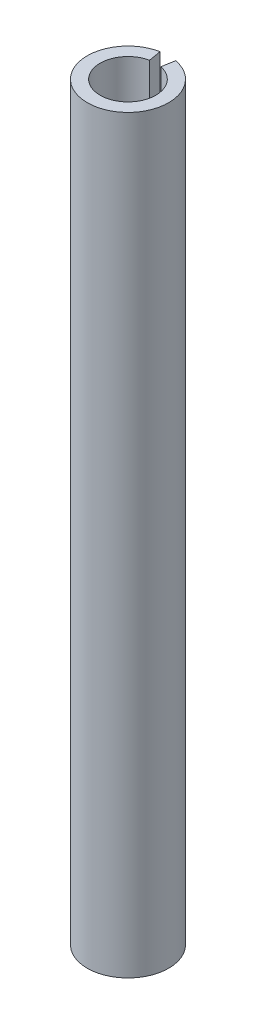
ISO-10303-21;
HEADER;
FILE_DESCRIPTION(('STEP AP214'),'2;1');
FILE_NAME('part.step','',(''),(''),'','','');
FILE_SCHEMA(('AUTOMOTIVE_DESIGN { 1 0 10303 214 1 1 1 1 }'));
ENDSEC;
DATA;
#1=APPLICATION_CONTEXT('core data for automotive mechanical design processes');
#2=APPLICATION_PROTOCOL_DEFINITION('international standard','automotive_design',2000,#1);
#3=PRODUCT_CONTEXT('',#1,'mechanical');
#4=PRODUCT('Part','Part','',(#3));
#5=PRODUCT_RELATED_PRODUCT_CATEGORY('part','',(#4));
#6=PRODUCT_DEFINITION_FORMATION('','',#4);
#7=PRODUCT_DEFINITION_CONTEXT('part definition',#1,'design');
#8=PRODUCT_DEFINITION('design','',#6,#7);
#9=PRODUCT_DEFINITION_SHAPE('','',#8);
#10=(LENGTH_UNIT() NAMED_UNIT(*) SI_UNIT(.MILLI.,.METRE.));
#11=(NAMED_UNIT(*) PLANE_ANGLE_UNIT() SI_UNIT($,.RADIAN.));
#12=(NAMED_UNIT(*) SI_UNIT($,.STERADIAN.) SOLID_ANGLE_UNIT());
#13=UNCERTAINTY_MEASURE_WITH_UNIT(LENGTH_MEASURE(1.E-05),#10,'distance_accuracy_value','');
#14=(GEOMETRIC_REPRESENTATION_CONTEXT(3) GLOBAL_UNCERTAINTY_ASSIGNED_CONTEXT((#13)) GLOBAL_UNIT_ASSIGNED_CONTEXT((#10,
#11,#12)) REPRESENTATION_CONTEXT('',''));
#15=CARTESIAN_POINT('',(0.,0.,0.));
#16=DIRECTION('',(0.,0.,1.));
#17=DIRECTION('',(1.,0.,0.));
#18=AXIS2_PLACEMENT_3D('',#15,#16,#17);
#19=CARTESIAN_POINT('',(0.,175.02,0.));
#20=DIRECTION('',(0.,1.,0.));
#21=DIRECTION('',(0.,0.,1.));
#22=AXIS2_PLACEMENT_3D('',#19,#20,#21);
#23=PLANE('',#22);
#24=DIRECTION('',(0.169230769230769,0.,-0.98557645403366));
#25=VECTOR('',#24,1.);
#26=CARTESIAN_POINT('',(0.218910676143961,175.02,0.0375885827680346));
#27=LINE('',#26,#25);
#28=CARTESIAN_POINT('',(1.31826826057475,175.02,-6.3649170295583));
#29=VERTEX_POINT('',#28);
#30=CARTESIAN_POINT('',(1.82616350462444,175.02,-9.32282826476911));
#31=VERTEX_POINT('',#30);
#32=EDGE_CURVE('E74',#29,#31,#27,.T.);
#33=ORIENTED_EDGE('',*,*,#32,.F.);
#34=CARTESIAN_POINT('',(0.,175.02,0.));
#35=DIRECTION('',(0.,1.,0.));
#36=DIRECTION('',(0.,0.,1.));
#37=AXIS2_PLACEMENT_3D('',#34,#35,#36);
#38=CIRCLE('',#37,6.5);
#39=CARTESIAN_POINT('',(-1.31826826057475,175.02,-6.3649170295583));
#40=VERTEX_POINT('',#39);
#41=EDGE_CURVE('E93',#40,#29,#38,.T.);
#42=ORIENTED_EDGE('',*,*,#41,.F.);
#43=DIRECTION('',(0.169230769230769,0.,0.98557645403366));
#44=VECTOR('',#43,1.);
#45=CARTESIAN_POINT('',(-0.218910676143961,175.02,0.0375885827680347));
#46=LINE('',#45,#44);
#47=CARTESIAN_POINT('',(-1.82616350462444,175.02,-9.32282826476911));
#48=VERTEX_POINT('',#47);
#49=EDGE_CURVE('E55',#48,#40,#46,.T.);
#50=ORIENTED_EDGE('',*,*,#49,.F.);
#51=CARTESIAN_POINT('',(0.,175.02,0.));
#52=DIRECTION('',(0.,1.,0.));
#53=DIRECTION('',(0.,0.,1.));
#54=AXIS2_PLACEMENT_3D('',#51,#52,#53);
#55=CIRCLE('',#54,9.5);
#56=EDGE_CURVE('E92',#48,#31,#55,.T.);
#57=ORIENTED_EDGE('',*,*,#56,.T.);
#58=EDGE_LOOP('',(#33,#42,#50,#57));
#59=FACE_BOUND('',#58,.T.);
#60=ADVANCED_FACE('F33',(#59),#23,.T.);
#61=CARTESIAN_POINT('',(0.,0.,0.));
#62=DIRECTION('',(0.,1.,0.));
#63=DIRECTION('',(0.,0.,1.));
#64=AXIS2_PLACEMENT_3D('',#61,#62,#63);
#65=PLANE('',#64);
#66=CARTESIAN_POINT('',(0.,0.,0.));
#67=DIRECTION('',(0.,1.,0.));
#68=DIRECTION('',(0.,0.,1.));
#69=AXIS2_PLACEMENT_3D('',#66,#67,#68);
#70=CIRCLE('',#69,6.5);
#71=CARTESIAN_POINT('',(-1.31826826057475,0.,-6.3649170295583));
#72=VERTEX_POINT('',#71);
#73=CARTESIAN_POINT('',(1.31826826057475,0.,-6.3649170295583));
#74=VERTEX_POINT('',#73);
#75=EDGE_CURVE('E79',#72,#74,#70,.T.);
#76=ORIENTED_EDGE('',*,*,#75,.T.);
#77=DIRECTION('',(0.169230769230769,0.,-0.98557645403366));
#78=VECTOR('',#77,1.);
#79=CARTESIAN_POINT('',(1.1,0.,-5.09375304878121));
#80=LINE('',#79,#78);
#81=CARTESIAN_POINT('',(1.82616350462444,0.,-9.32282826476911));
#82=VERTEX_POINT('',#81);
#83=EDGE_CURVE('E47',#74,#82,#80,.T.);
#84=ORIENTED_EDGE('',*,*,#83,.T.);
#85=CARTESIAN_POINT('',(0.,0.,0.));
#86=DIRECTION('',(0.,1.,0.));
#87=DIRECTION('',(0.,0.,1.));
#88=AXIS2_PLACEMENT_3D('',#85,#86,#87);
#89=CIRCLE('',#88,9.5);
#90=CARTESIAN_POINT('',(-1.82616350462444,0.,-9.32282826476911));
#91=VERTEX_POINT('',#90);
#92=EDGE_CURVE('E86',#91,#82,#89,.T.);
#93=ORIENTED_EDGE('',*,*,#92,.F.);
#94=DIRECTION('',(0.169230769230769,0.,0.98557645403366));
#95=VECTOR('',#94,1.);
#96=CARTESIAN_POINT('',(-2.2,0.,-11.5));
#97=LINE('',#96,#95);
#98=EDGE_CURVE('E88',#91,#72,#97,.T.);
#99=ORIENTED_EDGE('',*,*,#98,.T.);
#100=EDGE_LOOP('',(#76,#84,#93,#99));
#101=FACE_BOUND('',#100,.T.);
#102=ADVANCED_FACE('F84',(#101),#65,.F.);
#103=CARTESIAN_POINT('',(0.,175.02,0.));
#104=DIRECTION('',(0.,-1.,0.));
#105=DIRECTION('',(0.,0.,-1.));
#106=AXIS2_PLACEMENT_3D('',#103,#104,#105);
#107=CYLINDRICAL_SURFACE('',#106,9.5);
#108=ORIENTED_EDGE('',*,*,#92,.T.);
#109=DIRECTION('',(0.,-1.,0.));
#110=VECTOR('',#109,1.);
#111=CARTESIAN_POINT('',(1.82616350462444,175.02,-9.32282826476911));
#112=LINE('',#111,#110);
#113=EDGE_CURVE('E71',#82,#31,#112,.F.);
#114=ORIENTED_EDGE('',*,*,#113,.T.);
#115=ORIENTED_EDGE('',*,*,#56,.F.);
#116=DIRECTION('',(0.,-1.,0.));
#117=VECTOR('',#116,1.);
#118=CARTESIAN_POINT('',(-1.82616350462444,175.02,-9.32282826476911));
#119=LINE('',#118,#117);
#120=EDGE_CURVE('E91',#48,#91,#119,.T.);
#121=ORIENTED_EDGE('',*,*,#120,.T.);
#122=EDGE_LOOP('',(#108,#114,#115,#121));
#123=FACE_BOUND('',#122,.T.);
#124=ADVANCED_FACE('F35',(#123),#107,.T.);
#125=CARTESIAN_POINT('',(0.,175.02,0.));
#126=DIRECTION('',(0.,-1.,0.));
#127=DIRECTION('',(0.,0.,-1.));
#128=AXIS2_PLACEMENT_3D('',#125,#126,#127);
#129=CYLINDRICAL_SURFACE('',#128,6.5);
#130=DIRECTION('',(0.,-1.,0.));
#131=VECTOR('',#130,1.);
#132=CARTESIAN_POINT('',(1.31826826057475,175.02,-6.3649170295583));
#133=LINE('',#132,#131);
#134=EDGE_CURVE('E11',#74,#29,#133,.F.);
#135=ORIENTED_EDGE('',*,*,#134,.F.);
#136=ORIENTED_EDGE('',*,*,#75,.F.);
#137=DIRECTION('',(0.,-1.,0.));
#138=VECTOR('',#137,1.);
#139=CARTESIAN_POINT('',(-1.31826826057475,175.02,-6.3649170295583));
#140=LINE('',#139,#138);
#141=EDGE_CURVE('E41',#40,#72,#140,.T.);
#142=ORIENTED_EDGE('',*,*,#141,.F.);
#143=ORIENTED_EDGE('',*,*,#41,.T.);
#144=EDGE_LOOP('',(#135,#136,#142,#143));
#145=FACE_BOUND('',#144,.T.);
#146=ADVANCED_FACE('F103',(#145),#129,.F.);
#147=CARTESIAN_POINT('',(-2.2,0.,-11.5));
#148=DIRECTION('',(-0.985576454033659,0.,0.169230769230769));
#149=DIRECTION('',(0.169230769230769,0.,0.98557645403366));
#150=AXIS2_PLACEMENT_3D('',#147,#148,#149);
#151=PLANE('',#150);
#152=ORIENTED_EDGE('',*,*,#49,.T.);
#153=ORIENTED_EDGE('',*,*,#141,.T.);
#154=ORIENTED_EDGE('',*,*,#98,.F.);
#155=ORIENTED_EDGE('',*,*,#120,.F.);
#156=EDGE_LOOP('',(#152,#153,#154,#155));
#157=FACE_BOUND('',#156,.T.);
#158=ADVANCED_FACE('F99',(#157),#151,.F.);
#159=CARTESIAN_POINT('',(1.1,0.,-5.09375304878121));
#160=DIRECTION('',(0.985576454033659,0.,0.169230769230769));
#161=DIRECTION('',(0.169230769230769,0.,-0.98557645403366));
#162=AXIS2_PLACEMENT_3D('',#159,#160,#161);
#163=PLANE('',#162);
#164=ORIENTED_EDGE('',*,*,#83,.F.);
#165=ORIENTED_EDGE('',*,*,#134,.T.);
#166=ORIENTED_EDGE('',*,*,#32,.T.);
#167=ORIENTED_EDGE('',*,*,#113,.F.);
#168=EDGE_LOOP('',(#164,#165,#166,#167));
#169=FACE_BOUND('',#168,.T.);
#170=ADVANCED_FACE('F72',(#169),#163,.F.);
#171=CLOSED_SHELL('',(#60,#102,#124,#146,#158,#170));
#172=MANIFOLD_SOLID_BREP('B2',#171);
#173=ADVANCED_BREP_SHAPE_REPRESENTATION('',(#18,#172),#14);
#174=SHAPE_DEFINITION_REPRESENTATION(#9,#173);
ENDSEC;
END-ISO-10303-21;
